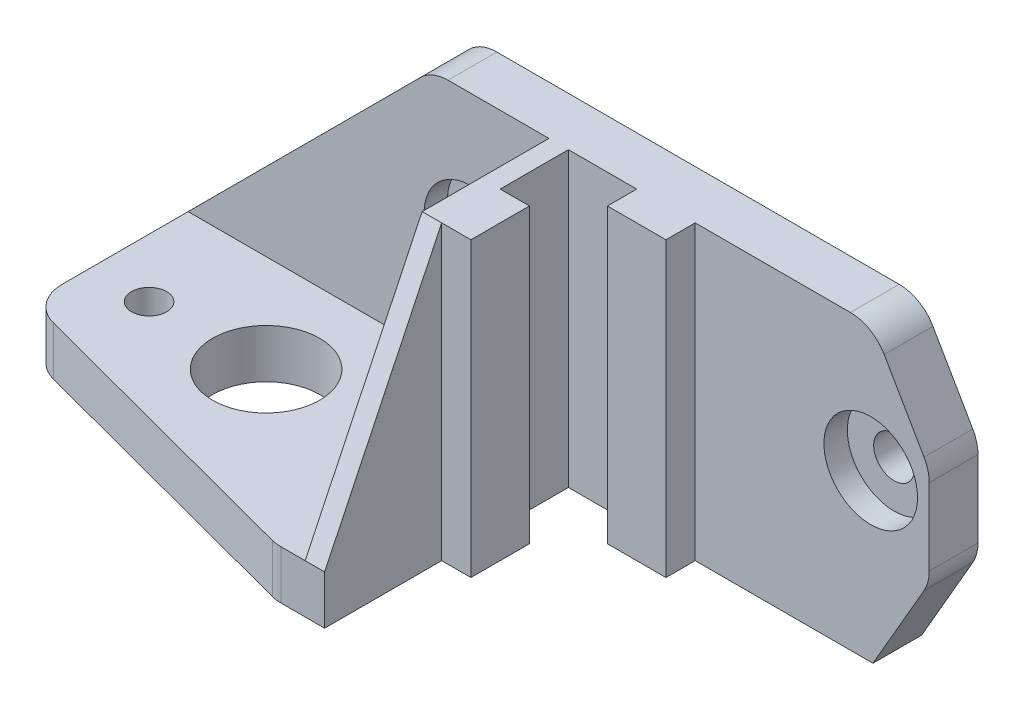
ISO-10303-21;
HEADER;
FILE_DESCRIPTION(('STEP AP214'),'2;1');
FILE_NAME('part.step','',(''),(''),'','','');
FILE_SCHEMA(('AUTOMOTIVE_DESIGN { 1 0 10303 214 1 1 1 1 }'));
ENDSEC;
DATA;
#1=APPLICATION_CONTEXT('core data for automotive mechanical design processes');
#2=APPLICATION_PROTOCOL_DEFINITION('international standard','automotive_design',2000,#1);
#3=PRODUCT_CONTEXT('',#1,'mechanical');
#4=PRODUCT('Part','Part','',(#3));
#5=PRODUCT_RELATED_PRODUCT_CATEGORY('part','',(#4));
#6=PRODUCT_DEFINITION_FORMATION('','',#4);
#7=PRODUCT_DEFINITION_CONTEXT('part definition',#1,'design');
#8=PRODUCT_DEFINITION('design','',#6,#7);
#9=PRODUCT_DEFINITION_SHAPE('','',#8);
#10=(LENGTH_UNIT() NAMED_UNIT(*) SI_UNIT(.MILLI.,.METRE.));
#11=(NAMED_UNIT(*) PLANE_ANGLE_UNIT() SI_UNIT($,.RADIAN.));
#12=(NAMED_UNIT(*) SI_UNIT($,.STERADIAN.) SOLID_ANGLE_UNIT());
#13=UNCERTAINTY_MEASURE_WITH_UNIT(LENGTH_MEASURE(1.E-05),#10,'distance_accuracy_value','');
#14=(GEOMETRIC_REPRESENTATION_CONTEXT(3) GLOBAL_UNCERTAINTY_ASSIGNED_CONTEXT((#13)) GLOBAL_UNIT_ASSIGNED_CONTEXT((#10,
#11,#12)) REPRESENTATION_CONTEXT('',''));
#15=CARTESIAN_POINT('',(0.,0.,0.));
#16=DIRECTION('',(0.,0.,1.));
#17=DIRECTION('',(1.,0.,0.));
#18=AXIS2_PLACEMENT_3D('',#15,#16,#17);
#19=CARTESIAN_POINT('',(21.,17.,-15.));
#20=DIRECTION('',(0.,0.,1.));
#21=DIRECTION('',(-1.,0.,0.));
#22=AXIS2_PLACEMENT_3D('',#19,#20,#21);
#23=CYLINDRICAL_SURFACE('',#22,2.1);
#24=CARTESIAN_POINT('',(21.,17.,-15.));
#25=DIRECTION('',(0.,0.,-1.));
#26=DIRECTION('',(-1.,0.,0.));
#27=AXIS2_PLACEMENT_3D('',#24,#25,#26);
#28=CIRCLE('',#27,2.1);
#29=CARTESIAN_POINT('',(18.9,17.,-15.));
#30=VERTEX_POINT('',#29);
#31=EDGE_CURVE('E291',#30,#30,#28,.T.);
#32=ORIENTED_EDGE('',*,*,#31,.T.);
#33=EDGE_LOOP('',(#32));
#34=FACE_BOUND('',#33,.T.);
#35=CARTESIAN_POINT('',(21.,17.,-12.4));
#36=DIRECTION('',(0.,0.,1.));
#37=DIRECTION('',(1.,0.,0.));
#38=AXIS2_PLACEMENT_3D('',#35,#36,#37);
#39=CIRCLE('',#38,2.1);
#40=CARTESIAN_POINT('',(23.1,17.,-12.4));
#41=VERTEX_POINT('',#40);
#42=EDGE_CURVE('E387',#41,#41,#39,.F.);
#43=ORIENTED_EDGE('',*,*,#42,.F.);
#44=EDGE_LOOP('',(#43));
#45=FACE_BOUND('',#44,.T.);
#46=ADVANCED_FACE('F33',(#34,#45),#23,.F.);
#47=CARTESIAN_POINT('',(-20.,17.,-15.));
#48=DIRECTION('',(0.,0.,1.));
#49=DIRECTION('',(-1.,0.,0.));
#50=AXIS2_PLACEMENT_3D('',#47,#48,#49);
#51=CYLINDRICAL_SURFACE('',#50,2.1);
#52=CARTESIAN_POINT('',(-20.,17.,-15.));
#53=DIRECTION('',(0.,0.,-1.));
#54=DIRECTION('',(-1.,0.,0.));
#55=AXIS2_PLACEMENT_3D('',#52,#53,#54);
#56=CIRCLE('',#55,2.1);
#57=CARTESIAN_POINT('',(-22.1,17.,-15.));
#58=VERTEX_POINT('',#57);
#59=EDGE_CURVE('E300',#58,#58,#56,.T.);
#60=ORIENTED_EDGE('',*,*,#59,.T.);
#61=EDGE_LOOP('',(#60));
#62=FACE_BOUND('',#61,.T.);
#63=CARTESIAN_POINT('',(-20.,17.,-12.4));
#64=DIRECTION('',(0.,0.,1.));
#65=DIRECTION('',(1.,0.,0.));
#66=AXIS2_PLACEMENT_3D('',#63,#64,#65);
#67=CIRCLE('',#66,2.1);
#68=CARTESIAN_POINT('',(-17.9,17.,-12.4));
#69=VERTEX_POINT('',#68);
#70=EDGE_CURVE('E234',#69,#69,#67,.F.);
#71=ORIENTED_EDGE('',*,*,#70,.F.);
#72=EDGE_LOOP('',(#71));
#73=FACE_BOUND('',#72,.T.);
#74=ADVANCED_FACE('F525',(#62,#73),#51,.F.);
#75=CARTESIAN_POINT('',(10.,0.,-10.));
#76=DIRECTION('',(0.,0.,-1.));
#77=DIRECTION('',(1.,0.,0.));
#78=AXIS2_PLACEMENT_3D('',#75,#76,#77);
#79=PLANE('',#78);
#80=DIRECTION('',(1.,0.,0.));
#81=VECTOR('',#80,1.);
#82=CARTESIAN_POINT('',(10.,0.,-10.));
#83=LINE('',#82,#81);
#84=CARTESIAN_POINT('',(-10.,0.,-10.));
#85=VERTEX_POINT('',#84);
#86=CARTESIAN_POINT('',(-3.,0.,-10.));
#87=VERTEX_POINT('',#86);
#88=EDGE_CURVE('E343',#85,#87,#83,.T.);
#89=ORIENTED_EDGE('',*,*,#88,.T.);
#90=DIRECTION('',(0.,1.,0.));
#91=VECTOR('',#90,1.);
#92=CARTESIAN_POINT('',(-3.,-6.70820393249936,-10.));
#93=LINE('',#92,#91);
#94=CARTESIAN_POINT('',(-3.,30.,-10.));
#95=VERTEX_POINT('',#94);
#96=EDGE_CURVE('E243',#87,#95,#93,.T.);
#97=ORIENTED_EDGE('',*,*,#96,.T.);
#98=DIRECTION('',(1.,0.,0.));
#99=VECTOR('',#98,1.);
#100=CARTESIAN_POINT('',(10.,30.,-10.));
#101=LINE('',#100,#99);
#102=CARTESIAN_POINT('',(-10.,30.,-10.));
#103=VERTEX_POINT('',#102);
#104=EDGE_CURVE('E233',#103,#95,#101,.T.);
#105=ORIENTED_EDGE('',*,*,#104,.F.);
#106=DIRECTION('',(0.,1.,0.));
#107=VECTOR('',#106,1.);
#108=CARTESIAN_POINT('',(-10.,0.,-10.));
#109=LINE('',#108,#107);
#110=EDGE_CURVE('E339',#85,#103,#109,.T.);
#111=ORIENTED_EDGE('',*,*,#110,.F.);
#112=EDGE_LOOP('',(#89,#97,#105,#111));
#113=FACE_BOUND('',#112,.T.);
#114=ADVANCED_FACE('F530',(#113),#79,.F.);
#115=CARTESIAN_POINT('',(-10.,0.,-10.));
#116=DIRECTION('',(-1.,0.,0.));
#117=DIRECTION('',(0.,0.,-1.));
#118=AXIS2_PLACEMENT_3D('',#115,#116,#117);
#119=PLANE('',#118);
#120=DIRECTION('',(0.,0.,-1.));
#121=VECTOR('',#120,1.);
#122=CARTESIAN_POINT('',(-10.,30.,-10.));
#123=LINE('',#122,#121);
#124=CARTESIAN_POINT('',(-10.,30.,-3.));
#125=VERTEX_POINT('',#124);
#126=EDGE_CURVE('E336',#125,#103,#123,.T.);
#127=ORIENTED_EDGE('',*,*,#126,.F.);
#128=DIRECTION('',(0.,1.,0.));
#129=VECTOR('',#128,1.);
#130=CARTESIAN_POINT('',(-10.,-6.70820393249936,-3.));
#131=LINE('',#130,#129);
#132=CARTESIAN_POINT('',(-10.,0.,-3.));
#133=VERTEX_POINT('',#132);
#134=EDGE_CURVE('E256',#133,#125,#131,.T.);
#135=ORIENTED_EDGE('',*,*,#134,.F.);
#136=DIRECTION('',(0.,0.,-1.));
#137=VECTOR('',#136,1.);
#138=CARTESIAN_POINT('',(-10.,0.,-10.));
#139=LINE('',#138,#137);
#140=EDGE_CURVE('E335',#133,#85,#139,.T.);
#141=ORIENTED_EDGE('',*,*,#140,.T.);
#142=ORIENTED_EDGE('',*,*,#110,.T.);
#143=EDGE_LOOP('',(#127,#135,#141,#142));
#144=FACE_BOUND('',#143,.T.);
#145=ADVANCED_FACE('F635',(#144),#119,.F.);
#146=CARTESIAN_POINT('',(-55.,5.,15.));
#147=DIRECTION('',(0.,-1.,0.));
#148=DIRECTION('',(0.,0.,-1.));
#149=AXIS2_PLACEMENT_3D('',#146,#147,#148);
#150=PLANE('',#149);
#151=CARTESIAN_POINT('',(-31.,5.,0.));
#152=DIRECTION('',(0.,1.,0.));
#153=DIRECTION('',(0.,0.,-1.));
#154=AXIS2_PLACEMENT_3D('',#151,#152,#153);
#155=CIRCLE('',#154,5.5);
#156=CARTESIAN_POINT('',(-31.,5.,-5.49999999999999));
#157=VERTEX_POINT('',#156);
#158=EDGE_CURVE('E331',#157,#157,#155,.T.);
#159=ORIENTED_EDGE('',*,*,#158,.F.);
#160=EDGE_LOOP('',(#159));
#161=FACE_BOUND('',#160,.T.);
#162=CARTESIAN_POINT('',(-19.,5.,0.));
#163=DIRECTION('',(0.,1.,0.));
#164=DIRECTION('',(0.,0.,-1.));
#165=AXIS2_PLACEMENT_3D('',#162,#163,#164);
#166=CIRCLE('',#165,1.8);
#167=CARTESIAN_POINT('',(-19.,5.,-1.8));
#168=VERTEX_POINT('',#167);
#169=EDGE_CURVE('E327',#168,#168,#166,.T.);
#170=ORIENTED_EDGE('',*,*,#169,.F.);
#171=EDGE_LOOP('',(#170));
#172=FACE_BOUND('',#171,.T.);
#173=CARTESIAN_POINT('',(-43.,5.,0.));
#174=DIRECTION('',(0.,1.,0.));
#175=DIRECTION('',(0.,0.,-1.));
#176=AXIS2_PLACEMENT_3D('',#173,#174,#175);
#177=CIRCLE('',#176,1.8);
#178=CARTESIAN_POINT('',(-43.,5.,-1.8));
#179=VERTEX_POINT('',#178);
#180=EDGE_CURVE('E323',#179,#179,#177,.T.);
#181=ORIENTED_EDGE('',*,*,#180,.F.);
#182=EDGE_LOOP('',(#181));
#183=FACE_BOUND('',#182,.T.);
#184=DIRECTION('',(0.,0.,1.));
#185=VECTOR('',#184,1.);
#186=CARTESIAN_POINT('',(-49.,5.,6.));
#187=LINE('',#186,#185);
#188=CARTESIAN_POINT('',(-49.,5.,-9.99999999999999));
#189=VERTEX_POINT('',#188);
#190=CARTESIAN_POINT('',(-49.,5.,2.92105755410142));
#191=VERTEX_POINT('',#190);
#192=EDGE_CURVE('E307',#189,#191,#187,.T.);
#193=ORIENTED_EDGE('',*,*,#192,.T.);
#194=CARTESIAN_POINT('',(-45.,5.,2.92105755410142));
#195=DIRECTION('',(0.,-1.,0.));
#196=DIRECTION('',(0.,0.,-1.));
#197=AXIS2_PLACEMENT_3D('',#194,#195,#196);
#198=CIRCLE('',#197,4.);
#199=CARTESIAN_POINT('',(-46.0235702412651,5.,6.78787846554746));
#200=VERTEX_POINT('',#199);
#201=EDGE_CURVE('E406',#191,#200,#198,.F.);
#202=ORIENTED_EDGE('',*,*,#201,.T.);
#203=DIRECTION('',(0.966705227861512,0.,0.255892560316283));
#204=VECTOR('',#203,1.);
#205=CARTESIAN_POINT('',(-15.,5.,15.));
#206=LINE('',#205,#204);
#207=CARTESIAN_POINT('',(-15.5031210012038,5.,14.866820911446));
#208=VERTEX_POINT('',#207);
#209=EDGE_CURVE('E312',#200,#208,#206,.T.);
#210=ORIENTED_EDGE('',*,*,#209,.T.);
#211=CARTESIAN_POINT('',(-14.4795507599387,5.,11.));
#212=DIRECTION('',(0.,-1.,0.));
#213=DIRECTION('',(0.,0.,-1.));
#214=AXIS2_PLACEMENT_3D('',#211,#212,#213);
#215=CIRCLE('',#214,4.);
#216=CARTESIAN_POINT('',(-14.4795507599387,5.,15.));
#217=VERTEX_POINT('',#216);
#218=EDGE_CURVE('E370',#208,#217,#215,.F.);
#219=ORIENTED_EDGE('',*,*,#218,.T.);
#220=DIRECTION('',(1.,0.,0.));
#221=VECTOR('',#220,1.);
#222=CARTESIAN_POINT('',(-15.,5.,15.));
#223=LINE('',#222,#221);
#224=CARTESIAN_POINT('',(-12.,5.,15.));
#225=VERTEX_POINT('',#224);
#226=EDGE_CURVE('E284',#217,#225,#223,.T.);
#227=ORIENTED_EDGE('',*,*,#226,.T.);
#228=DIRECTION('',(0.,0.,-1.));
#229=VECTOR('',#228,1.);
#230=CARTESIAN_POINT('',(-12.,5.,-10.));
#231=LINE('',#230,#229);
#232=CARTESIAN_POINT('',(-12.,5.,-10.));
#233=VERTEX_POINT('',#232);
#234=EDGE_CURVE('E285',#225,#233,#231,.T.);
#235=ORIENTED_EDGE('',*,*,#234,.T.);
#236=DIRECTION('',(1.,0.,0.));
#237=VECTOR('',#236,1.);
#238=CARTESIAN_POINT('',(-74.4950975679639,5.,-10.));
#239=LINE('',#238,#237);
#240=EDGE_CURVE('E303',#189,#233,#239,.T.);
#241=ORIENTED_EDGE('',*,*,#240,.F.);
#242=EDGE_LOOP('',(#193,#202,#210,#219,#227,#235,#241));
#243=FACE_BOUND('',#242,.T.);
#244=ADVANCED_FACE('F621',(#161,#172,#183,#243),#150,.F.);
#245=CARTESIAN_POINT('',(15.,30.,15.));
#246=DIRECTION('',(0.,0.,-1.));
#247=DIRECTION('',(1.,0.,0.));
#248=AXIS2_PLACEMENT_3D('',#245,#246,#247);
#249=PLANE('',#248);
#250=ORIENTED_EDGE('',*,*,#226,.F.);
#251=DIRECTION('',(0.,1.,0.));
#252=VECTOR('',#251,1.);
#253=CARTESIAN_POINT('',(-14.4795507599387,30.,15.));
#254=LINE('',#253,#252);
#255=CARTESIAN_POINT('',(-14.4795507599387,0.,15.));
#256=VERTEX_POINT('',#255);
#257=EDGE_CURVE('E420',#217,#256,#254,.F.);
#258=ORIENTED_EDGE('',*,*,#257,.T.);
#259=DIRECTION('',(-1.,0.,0.));
#260=VECTOR('',#259,1.);
#261=CARTESIAN_POINT('',(15.,0.,15.));
#262=LINE('',#261,#260);
#263=CARTESIAN_POINT('',(-10.,0.,15.));
#264=VERTEX_POINT('',#263);
#265=EDGE_CURVE('E342',#264,#256,#262,.T.);
#266=ORIENTED_EDGE('',*,*,#265,.F.);
#267=DIRECTION('',(0.,1.,0.));
#268=VECTOR('',#267,1.);
#269=CARTESIAN_POINT('',(-10.,-5.00000000014378E-05,15.));
#270=LINE('',#269,#268);
#271=CARTESIAN_POINT('',(-10.,4.99999999999979,15.));
#272=VERTEX_POINT('',#271);
#273=EDGE_CURVE('E278',#264,#272,#270,.T.);
#274=ORIENTED_EDGE('',*,*,#273,.T.);
#275=DIRECTION('',(-1.,0.,0.));
#276=VECTOR('',#275,1.);
#277=CARTESIAN_POINT('',(-12.,4.9999999999998,15.));
#278=LINE('',#277,#276);
#279=EDGE_CURVE('E392',#272,#225,#278,.T.);
#280=ORIENTED_EDGE('',*,*,#279,.T.);
#281=EDGE_LOOP('',(#250,#258,#266,#274,#280));
#282=FACE_BOUND('',#281,.T.);
#283=ADVANCED_FACE('F618',(#282),#249,.F.);
#284=CARTESIAN_POINT('',(15.,30.,-15.));
#285=DIRECTION('',(0.,0.,1.));
#286=DIRECTION('',(-1.,0.,0.));
#287=AXIS2_PLACEMENT_3D('',#284,#285,#286);
#288=PLANE('',#287);
#289=ORIENTED_EDGE('',*,*,#31,.F.);
#290=EDGE_LOOP('',(#289));
#291=FACE_BOUND('',#290,.T.);
#292=ORIENTED_EDGE('',*,*,#59,.F.);
#293=EDGE_LOOP('',(#292));
#294=FACE_BOUND('',#293,.T.);
#295=DIRECTION('',(0.,-1.,0.));
#296=VECTOR('',#295,1.);
#297=CARTESIAN_POINT('',(27.,30.,-15.));
#298=LINE('',#297,#296);
#299=CARTESIAN_POINT('',(27.,18.9282032302755,-15.));
#300=VERTEX_POINT('',#299);
#301=CARTESIAN_POINT('',(27.,11.0717967697245,-15.));
#302=VERTEX_POINT('',#301);
#303=EDGE_CURVE('E294',#300,#302,#298,.T.);
#304=ORIENTED_EDGE('',*,*,#303,.T.);
#305=CARTESIAN_POINT('',(23.,11.0717967697245,-15.));
#306=DIRECTION('',(0.,0.,1.));
#307=DIRECTION('',(1.,0.,0.));
#308=AXIS2_PLACEMENT_3D('',#305,#306,#307);
#309=CIRCLE('',#308,4.);
#310=CARTESIAN_POINT('',(26.4641016151378,9.07179676972453,-15.));
#311=VERTEX_POINT('',#310);
#312=EDGE_CURVE('E441',#302,#311,#309,.F.);
#313=ORIENTED_EDGE('',*,*,#312,.T.);
#314=DIRECTION('',(0.499999999999998,0.86602540378444,0.));
#315=VECTOR('',#314,1.);
#316=CARTESIAN_POINT('',(27.,10.,-15.));
#317=LINE('',#316,#315);
#318=CARTESIAN_POINT('',(21.2264973081038,0.,-15.));
#319=VERTEX_POINT('',#318);
#320=EDGE_CURVE('E465',#319,#311,#317,.T.);
#321=ORIENTED_EDGE('',*,*,#320,.F.);
#322=DIRECTION('',(1.,0.,0.));
#323=VECTOR('',#322,1.);
#324=CARTESIAN_POINT('',(15.,0.,-15.));
#325=LINE('',#324,#323);
#326=CARTESIAN_POINT('',(-49.,0.,-15.));
#327=VERTEX_POINT('',#326);
#328=EDGE_CURVE('E348',#327,#319,#325,.T.);
#329=ORIENTED_EDGE('',*,*,#328,.F.);
#330=DIRECTION('',(0.,1.,0.));
#331=VECTOR('',#330,1.);
#332=CARTESIAN_POINT('',(-49.,0.,-15.));
#333=LINE('',#332,#331);
#334=CARTESIAN_POINT('',(-49.,4.9999999999999,-15.));
#335=VERTEX_POINT('',#334);
#336=EDGE_CURVE('E315',#327,#335,#333,.T.);
#337=ORIENTED_EDGE('',*,*,#336,.T.);
#338=DIRECTION('',(-0.707106781186546,-0.707106781186549,0.));
#339=VECTOR('',#338,1.);
#340=CARTESIAN_POINT('',(-24.,30.,-15.));
#341=LINE('',#340,#339);
#342=CARTESIAN_POINT('',(-25.1715728752538,28.8284271247462,-15.));
#343=VERTEX_POINT('',#342);
#344=EDGE_CURVE('E347',#343,#335,#341,.T.);
#345=ORIENTED_EDGE('',*,*,#344,.F.);
#346=CARTESIAN_POINT('',(-22.3431457505076,26.,-15.));
#347=DIRECTION('',(0.,0.,1.));
#348=DIRECTION('',(1.,0.,0.));
#349=AXIS2_PLACEMENT_3D('',#346,#347,#348);
#350=CIRCLE('',#349,4.);
#351=CARTESIAN_POINT('',(-22.3431457505076,30.,-15.));
#352=VERTEX_POINT('',#351);
#353=EDGE_CURVE('E435',#343,#352,#350,.F.);
#354=ORIENTED_EDGE('',*,*,#353,.T.);
#355=DIRECTION('',(1.,0.,0.));
#356=VECTOR('',#355,1.);
#357=CARTESIAN_POINT('',(15.,30.,-15.));
#358=LINE('',#357,#356);
#359=CARTESIAN_POINT('',(18.9170962313452,30.,-15.));
#360=VERTEX_POINT('',#359);
#361=EDGE_CURVE('E344',#352,#360,#358,.T.);
#362=ORIENTED_EDGE('',*,*,#361,.T.);
#363=CARTESIAN_POINT('',(18.9170962313452,26.,-15.));
#364=DIRECTION('',(0.,0.,1.));
#365=DIRECTION('',(1.,0.,0.));
#366=AXIS2_PLACEMENT_3D('',#363,#364,#365);
#367=CIRCLE('',#366,4.);
#368=CARTESIAN_POINT('',(22.381197846483,28.,-15.));
#369=VERTEX_POINT('',#368);
#370=EDGE_CURVE('E437',#360,#369,#367,.F.);
#371=ORIENTED_EDGE('',*,*,#370,.T.);
#372=DIRECTION('',(0.499999999999998,-0.86602540378444,0.));
#373=VECTOR('',#372,1.);
#374=CARTESIAN_POINT('',(27.,20.,-15.));
#375=LINE('',#374,#373);
#376=CARTESIAN_POINT('',(26.4641016151378,20.9282032302755,-15.));
#377=VERTEX_POINT('',#376);
#378=EDGE_CURVE('E470',#377,#369,#375,.F.);
#379=ORIENTED_EDGE('',*,*,#378,.F.);
#380=CARTESIAN_POINT('',(23.,18.9282032302755,-15.));
#381=DIRECTION('',(0.,0.,1.));
#382=DIRECTION('',(1.,0.,0.));
#383=AXIS2_PLACEMENT_3D('',#380,#381,#382);
#384=CIRCLE('',#383,4.);
#385=EDGE_CURVE('E439',#377,#300,#384,.F.);
#386=ORIENTED_EDGE('',*,*,#385,.T.);
#387=EDGE_LOOP('',(#304,#313,#321,#329,#337,#345,#354,#362,#371,#379,#386));
#388=FACE_BOUND('',#387,.T.);
#389=ADVANCED_FACE('F461',(#291,#294,#388),#288,.F.);
#390=CARTESIAN_POINT('',(0.,30.,0.));
#391=DIRECTION('',(0.,1.,0.));
#392=DIRECTION('',(0.,0.,1.));
#393=AXIS2_PLACEMENT_3D('',#390,#391,#392);
#394=PLANE('',#393);
#395=CARTESIAN_POINT('',(3.,30.,-10.));
#396=VERTEX_POINT('',#395);
#397=CARTESIAN_POINT('',(18.9170962313452,30.,-10.));
#398=VERTEX_POINT('',#397);
#399=EDGE_CURVE('E338',#396,#398,#101,.T.);
#400=ORIENTED_EDGE('',*,*,#399,.T.);
#401=DIRECTION('',(0.,0.,-1.));
#402=VECTOR('',#401,1.);
#403=CARTESIAN_POINT('',(18.9170962313452,30.,0.));
#404=LINE('',#403,#402);
#405=EDGE_CURVE('E450',#398,#360,#404,.T.);
#406=ORIENTED_EDGE('',*,*,#405,.T.);
#407=ORIENTED_EDGE('',*,*,#361,.F.);
#408=DIRECTION('',(0.,0.,-1.));
#409=VECTOR('',#408,1.);
#410=CARTESIAN_POINT('',(-22.3431457505076,30.,0.));
#411=LINE('',#410,#409);
#412=CARTESIAN_POINT('',(-22.3431457505076,30.,-10.));
#413=VERTEX_POINT('',#412);
#414=EDGE_CURVE('E54',#352,#413,#411,.F.);
#415=ORIENTED_EDGE('',*,*,#414,.T.);
#416=DIRECTION('',(1.,0.,0.));
#417=VECTOR('',#416,1.);
#418=CARTESIAN_POINT('',(-74.4950975679639,30.,-10.));
#419=LINE('',#418,#417);
#420=CARTESIAN_POINT('',(-12.,30.,-10.));
#421=VERTEX_POINT('',#420);
#422=EDGE_CURVE('E305',#413,#421,#419,.T.);
#423=ORIENTED_EDGE('',*,*,#422,.T.);
#424=DIRECTION('',(0.,0.,-1.));
#425=VECTOR('',#424,1.);
#426=CARTESIAN_POINT('',(-12.,30.,-10.));
#427=LINE('',#426,#425);
#428=CARTESIAN_POINT('',(-12.,30.,2.99999999999998));
#429=VERTEX_POINT('',#428);
#430=EDGE_CURVE('E281',#429,#421,#427,.T.);
#431=ORIENTED_EDGE('',*,*,#430,.F.);
#432=DIRECTION('',(1.,0.,0.));
#433=VECTOR('',#432,1.);
#434=CARTESIAN_POINT('',(-10.,30.,2.99999999999998));
#435=LINE('',#434,#433);
#436=CARTESIAN_POINT('',(-10.,30.,3.));
#437=VERTEX_POINT('',#436);
#438=EDGE_CURVE('E397',#429,#437,#435,.T.);
#439=ORIENTED_EDGE('',*,*,#438,.T.);
#440=DIRECTION('',(1.,0.,0.));
#441=VECTOR('',#440,1.);
#442=CARTESIAN_POINT('',(-10.,30.,3.));
#443=LINE('',#442,#441);
#444=CARTESIAN_POINT('',(-7.,30.,3.));
#445=VERTEX_POINT('',#444);
#446=EDGE_CURVE('E252',#437,#445,#443,.T.);
#447=ORIENTED_EDGE('',*,*,#446,.T.);
#448=DIRECTION('',(0.,0.,-1.));
#449=VECTOR('',#448,1.);
#450=CARTESIAN_POINT('',(-7.,30.,-3.));
#451=LINE('',#450,#449);
#452=CARTESIAN_POINT('',(-7.,30.,-3.));
#453=VERTEX_POINT('',#452);
#454=EDGE_CURVE('E261',#445,#453,#451,.T.);
#455=ORIENTED_EDGE('',*,*,#454,.T.);
#456=DIRECTION('',(-1.,0.,0.));
#457=VECTOR('',#456,1.);
#458=CARTESIAN_POINT('',(-10.,30.,-3.));
#459=LINE('',#458,#457);
#460=EDGE_CURVE('E264',#453,#125,#459,.T.);
#461=ORIENTED_EDGE('',*,*,#460,.T.);
#462=ORIENTED_EDGE('',*,*,#126,.T.);
#463=ORIENTED_EDGE('',*,*,#104,.T.);
#464=DIRECTION('',(0.,0.,1.));
#465=VECTOR('',#464,1.);
#466=CARTESIAN_POINT('',(-3.,30.,-10.));
#467=LINE('',#466,#465);
#468=CARTESIAN_POINT('',(-3.,30.,-7.));
#469=VERTEX_POINT('',#468);
#470=EDGE_CURVE('E214',#95,#469,#467,.T.);
#471=ORIENTED_EDGE('',*,*,#470,.T.);
#472=DIRECTION('',(1.,0.,0.));
#473=VECTOR('',#472,1.);
#474=CARTESIAN_POINT('',(-3.,30.,-7.));
#475=LINE('',#474,#473);
#476=CARTESIAN_POINT('',(3.,30.,-7.));
#477=VERTEX_POINT('',#476);
#478=EDGE_CURVE('E223',#469,#477,#475,.T.);
#479=ORIENTED_EDGE('',*,*,#478,.T.);
#480=DIRECTION('',(0.,0.,-1.));
#481=VECTOR('',#480,1.);
#482=CARTESIAN_POINT('',(3.,30.,-10.));
#483=LINE('',#482,#481);
#484=EDGE_CURVE('E220',#477,#396,#483,.T.);
#485=ORIENTED_EDGE('',*,*,#484,.T.);
#486=EDGE_LOOP('',(#400,#406,#407,#415,#423,#431,#439,#447,#455,#461,#462,#463,#471,#479,#485));
#487=FACE_BOUND('',#486,.T.);
#488=ADVANCED_FACE('F231',(#487),#394,.T.);
#489=CARTESIAN_POINT('',(0.,0.,0.));
#490=DIRECTION('',(0.,1.,0.));
#491=DIRECTION('',(0.,0.,1.));
#492=AXIS2_PLACEMENT_3D('',#489,#490,#491);
#493=PLANE('',#492);
#494=CARTESIAN_POINT('',(-43.,0.,0.));
#495=DIRECTION('',(0.,1.,0.));
#496=DIRECTION('',(0.,0.,-1.));
#497=AXIS2_PLACEMENT_3D('',#494,#495,#496);
#498=CIRCLE('',#497,1.8);
#499=CARTESIAN_POINT('',(-43.,0.,-1.8));
#500=VERTEX_POINT('',#499);
#501=EDGE_CURVE('E320',#500,#500,#498,.T.);
#502=ORIENTED_EDGE('',*,*,#501,.T.);
#503=EDGE_LOOP('',(#502));
#504=FACE_BOUND('',#503,.T.);
#505=CARTESIAN_POINT('',(-19.,0.,0.));
#506=DIRECTION('',(0.,1.,0.));
#507=DIRECTION('',(0.,0.,-1.));
#508=AXIS2_PLACEMENT_3D('',#505,#506,#507);
#509=CIRCLE('',#508,1.8);
#510=CARTESIAN_POINT('',(-19.,0.,-1.8));
#511=VERTEX_POINT('',#510);
#512=EDGE_CURVE('E324',#511,#511,#509,.T.);
#513=ORIENTED_EDGE('',*,*,#512,.T.);
#514=EDGE_LOOP('',(#513));
#515=FACE_BOUND('',#514,.T.);
#516=CARTESIAN_POINT('',(-31.,0.,0.));
#517=DIRECTION('',(0.,1.,0.));
#518=DIRECTION('',(0.,0.,-1.));
#519=AXIS2_PLACEMENT_3D('',#516,#517,#518);
#520=CIRCLE('',#519,5.5);
#521=CARTESIAN_POINT('',(-31.,0.,-5.49999999999999));
#522=VERTEX_POINT('',#521);
#523=EDGE_CURVE('E328',#522,#522,#520,.T.);
#524=ORIENTED_EDGE('',*,*,#523,.T.);
#525=EDGE_LOOP('',(#524));
#526=FACE_BOUND('',#525,.T.);
#527=DIRECTION('',(0.966705227861512,0.,0.255892560316283));
#528=VECTOR('',#527,1.);
#529=CARTESIAN_POINT('',(-15.,0.,15.));
#530=LINE('',#529,#528);
#531=CARTESIAN_POINT('',(-46.0235702412651,0.,6.78787846554746));
#532=VERTEX_POINT('',#531);
#533=CARTESIAN_POINT('',(-15.5031210012038,0.,14.866820911446));
#534=VERTEX_POINT('',#533);
#535=EDGE_CURVE('E311',#532,#534,#530,.T.);
#536=ORIENTED_EDGE('',*,*,#535,.F.);
#537=CARTESIAN_POINT('',(-45.,0.,2.92105755410142));
#538=DIRECTION('',(0.,1.,0.));
#539=DIRECTION('',(0.,0.,1.));
#540=AXIS2_PLACEMENT_3D('',#537,#538,#539);
#541=CIRCLE('',#540,4.);
#542=CARTESIAN_POINT('',(-49.,0.,2.92105755410142));
#543=VERTEX_POINT('',#542);
#544=EDGE_CURVE('E418',#532,#543,#541,.F.);
#545=ORIENTED_EDGE('',*,*,#544,.T.);
#546=DIRECTION('',(0.,0.,1.));
#547=VECTOR('',#546,1.);
#548=CARTESIAN_POINT('',(-49.,0.,6.));
#549=LINE('',#548,#547);
#550=EDGE_CURVE('E308',#327,#543,#549,.T.);
#551=ORIENTED_EDGE('',*,*,#550,.F.);
#552=ORIENTED_EDGE('',*,*,#328,.T.);
#553=DIRECTION('',(0.,0.,-1.));
#554=VECTOR('',#553,1.);
#555=CARTESIAN_POINT('',(21.2264973081038,0.,-15.));
#556=LINE('',#555,#554);
#557=CARTESIAN_POINT('',(21.2264973081038,0.,-9.99999999999999));
#558=VERTEX_POINT('',#557);
#559=EDGE_CURVE('E375',#558,#319,#556,.T.);
#560=ORIENTED_EDGE('',*,*,#559,.F.);
#561=CARTESIAN_POINT('',(3.,0.,-10.));
#562=VERTEX_POINT('',#561);
#563=EDGE_CURVE('E334',#562,#558,#83,.T.);
#564=ORIENTED_EDGE('',*,*,#563,.F.);
#565=DIRECTION('',(0.,0.,1.));
#566=VECTOR('',#565,1.);
#567=CARTESIAN_POINT('',(3.,0.,-10.));
#568=LINE('',#567,#566);
#569=CARTESIAN_POINT('',(3.,0.,-7.));
#570=VERTEX_POINT('',#569);
#571=EDGE_CURVE('E245',#562,#570,#568,.T.);
#572=ORIENTED_EDGE('',*,*,#571,.T.);
#573=DIRECTION('',(-1.,0.,0.));
#574=VECTOR('',#573,1.);
#575=CARTESIAN_POINT('',(-3.,0.,-7.));
#576=LINE('',#575,#574);
#577=CARTESIAN_POINT('',(-3.,0.,-7.));
#578=VERTEX_POINT('',#577);
#579=EDGE_CURVE('E250',#570,#578,#576,.T.);
#580=ORIENTED_EDGE('',*,*,#579,.T.);
#581=DIRECTION('',(0.,0.,-1.));
#582=VECTOR('',#581,1.);
#583=CARTESIAN_POINT('',(-3.,0.,-10.));
#584=LINE('',#583,#582);
#585=EDGE_CURVE('E216',#578,#87,#584,.T.);
#586=ORIENTED_EDGE('',*,*,#585,.T.);
#587=ORIENTED_EDGE('',*,*,#88,.F.);
#588=ORIENTED_EDGE('',*,*,#140,.F.);
#589=DIRECTION('',(1.,0.,0.));
#590=VECTOR('',#589,1.);
#591=CARTESIAN_POINT('',(-10.,0.,-3.));
#592=LINE('',#591,#590);
#593=CARTESIAN_POINT('',(-7.,0.,-3.));
#594=VERTEX_POINT('',#593);
#595=EDGE_CURVE('E255',#133,#594,#592,.T.);
#596=ORIENTED_EDGE('',*,*,#595,.T.);
#597=DIRECTION('',(0.,0.,1.));
#598=VECTOR('',#597,1.);
#599=CARTESIAN_POINT('',(-7.,0.,-3.));
#600=LINE('',#599,#598);
#601=CARTESIAN_POINT('',(-7.,0.,3.));
#602=VERTEX_POINT('',#601);
#603=EDGE_CURVE('E253',#594,#602,#600,.T.);
#604=ORIENTED_EDGE('',*,*,#603,.T.);
#605=DIRECTION('',(-1.,0.,0.));
#606=VECTOR('',#605,1.);
#607=CARTESIAN_POINT('',(-10.,0.,3.));
#608=LINE('',#607,#606);
#609=CARTESIAN_POINT('',(-10.,0.,3.));
#610=VERTEX_POINT('',#609);
#611=EDGE_CURVE('E258',#602,#610,#608,.T.);
#612=ORIENTED_EDGE('',*,*,#611,.T.);
#613=EDGE_CURVE('E332',#264,#610,#139,.T.);
#614=ORIENTED_EDGE('',*,*,#613,.F.);
#615=ORIENTED_EDGE('',*,*,#265,.T.);
#616=CARTESIAN_POINT('',(-14.4795507599387,0.,11.));
#617=DIRECTION('',(0.,1.,0.));
#618=DIRECTION('',(0.,0.,1.));
#619=AXIS2_PLACEMENT_3D('',#616,#617,#618);
#620=CIRCLE('',#619,4.);
#621=EDGE_CURVE('E416',#256,#534,#620,.F.);
#622=ORIENTED_EDGE('',*,*,#621,.T.);
#623=EDGE_LOOP('',(#536,#545,#551,#552,#560,#564,#572,#580,#586,#587,#588,#596,#604,#612,#614,
#615,#622));
#624=FACE_BOUND('',#623,.T.);
#625=ADVANCED_FACE('F487',(#504,#515,#526,#624),#493,.F.);
#626=CARTESIAN_POINT('',(21.,17.,-10.));
#627=DIRECTION('',(0.,0.,1.));
#628=DIRECTION('',(1.,0.,0.));
#629=AXIS2_PLACEMENT_3D('',#626,#627,#628);
#630=CIRCLE('',#629,4.8);
#631=CARTESIAN_POINT('',(25.8,17.,-10.));
#632=VERTEX_POINT('',#631);
#633=EDGE_CURVE('E578',#632,#632,#630,.T.);
#634=ORIENTED_EDGE('',*,*,#633,.F.);
#635=EDGE_LOOP('',(#634));
#636=FACE_BOUND('',#635,.T.);
#637=DIRECTION('',(-0.499999999999998,-0.86602540378444,0.));
#638=VECTOR('',#637,1.);
#639=CARTESIAN_POINT('',(27.,10.,-10.));
#640=LINE('',#639,#638);
#641=CARTESIAN_POINT('',(26.4641016151378,9.07179676972453,-10.));
#642=VERTEX_POINT('',#641);
#643=EDGE_CURVE('E473',#642,#558,#640,.T.);
#644=ORIENTED_EDGE('',*,*,#643,.F.);
#645=CARTESIAN_POINT('',(23.,11.0717967697245,-10.));
#646=DIRECTION('',(0.,0.,-1.));
#647=DIRECTION('',(-1.,0.,0.));
#648=AXIS2_PLACEMENT_3D('',#645,#646,#647);
#649=CIRCLE('',#648,4.);
#650=CARTESIAN_POINT('',(27.,11.0717967697245,-10.));
#651=VERTEX_POINT('',#650);
#652=EDGE_CURVE('E429',#642,#651,#649,.F.);
#653=ORIENTED_EDGE('',*,*,#652,.T.);
#654=DIRECTION('',(0.,1.,0.));
#655=VECTOR('',#654,1.);
#656=CARTESIAN_POINT('',(27.,30.,-10.));
#657=LINE('',#656,#655);
#658=CARTESIAN_POINT('',(27.,18.9282032302755,-10.));
#659=VERTEX_POINT('',#658);
#660=EDGE_CURVE('E297',#651,#659,#657,.T.);
#661=ORIENTED_EDGE('',*,*,#660,.T.);
#662=CARTESIAN_POINT('',(23.,18.9282032302755,-10.));
#663=DIRECTION('',(0.,0.,-1.));
#664=DIRECTION('',(-1.,0.,0.));
#665=AXIS2_PLACEMENT_3D('',#662,#663,#664);
#666=CIRCLE('',#665,4.);
#667=CARTESIAN_POINT('',(26.4641016151378,20.9282032302755,-10.));
#668=VERTEX_POINT('',#667);
#669=EDGE_CURVE('E427',#659,#668,#666,.F.);
#670=ORIENTED_EDGE('',*,*,#669,.T.);
#671=DIRECTION('',(-0.499999999999998,0.86602540378444,0.));
#672=VECTOR('',#671,1.);
#673=CARTESIAN_POINT('',(27.,20.,-10.));
#674=LINE('',#673,#672);
#675=CARTESIAN_POINT('',(22.381197846483,28.,-10.));
#676=VERTEX_POINT('',#675);
#677=EDGE_CURVE('E474',#676,#668,#674,.F.);
#678=ORIENTED_EDGE('',*,*,#677,.F.);
#679=CARTESIAN_POINT('',(18.9170962313452,26.,-10.));
#680=DIRECTION('',(0.,0.,-1.));
#681=DIRECTION('',(-1.,0.,0.));
#682=AXIS2_PLACEMENT_3D('',#679,#680,#681);
#683=CIRCLE('',#682,4.);
#684=EDGE_CURVE('E425',#676,#398,#683,.F.);
#685=ORIENTED_EDGE('',*,*,#684,.T.);
#686=ORIENTED_EDGE('',*,*,#399,.F.);
#687=DIRECTION('',(0.,1.,0.));
#688=VECTOR('',#687,1.);
#689=CARTESIAN_POINT('',(3.,-6.70820393249936,-10.));
#690=LINE('',#689,#688);
#691=EDGE_CURVE('E246',#562,#396,#690,.T.);
#692=ORIENTED_EDGE('',*,*,#691,.F.);
#693=ORIENTED_EDGE('',*,*,#563,.T.);
#694=EDGE_LOOP('',(#644,#653,#661,#670,#678,#685,#686,#692,#693));
#695=FACE_BOUND('',#694,.T.);
#696=ADVANCED_FACE('F494',(#636,#695),#79,.F.);
#697=DIRECTION('',(0.,1.,0.));
#698=VECTOR('',#697,1.);
#699=CARTESIAN_POINT('',(-10.,-6.70820393249936,3.));
#700=LINE('',#699,#698);
#701=EDGE_CURVE('E267',#610,#437,#700,.T.);
#702=ORIENTED_EDGE('',*,*,#701,.T.);
#703=DIRECTION('',(0.,-0.901523057468275,0.432731067584769));
#704=VECTOR('',#703,1.);
#705=CARTESIAN_POINT('',(-10.,4.9999999999998,15.));
#706=LINE('',#705,#704);
#707=EDGE_CURVE('E398',#437,#272,#706,.T.);
#708=ORIENTED_EDGE('',*,*,#707,.T.);
#709=ORIENTED_EDGE('',*,*,#273,.F.);
#710=ORIENTED_EDGE('',*,*,#613,.T.);
#711=EDGE_LOOP('',(#702,#708,#709,#710));
#712=FACE_BOUND('',#711,.T.);
#713=ADVANCED_FACE('F631',(#712),#119,.F.);
#714=CARTESIAN_POINT('',(-31.,30.000025,0.));
#715=DIRECTION('',(0.,-1.,0.));
#716=DIRECTION('',(0.,0.,-1.));
#717=AXIS2_PLACEMENT_3D('',#714,#715,#716);
#718=CYLINDRICAL_SURFACE('',#717,5.5);
#719=ORIENTED_EDGE('',*,*,#523,.F.);
#720=EDGE_LOOP('',(#719));
#721=FACE_BOUND('',#720,.T.);
#722=ORIENTED_EDGE('',*,*,#158,.T.);
#723=EDGE_LOOP('',(#722));
#724=FACE_BOUND('',#723,.T.);
#725=ADVANCED_FACE('F634',(#721,#724),#718,.F.);
#726=CARTESIAN_POINT('',(-19.,30.000025,0.));
#727=DIRECTION('',(0.,-1.,0.));
#728=DIRECTION('',(0.,0.,-1.));
#729=AXIS2_PLACEMENT_3D('',#726,#727,#728);
#730=CYLINDRICAL_SURFACE('',#729,1.8);
#731=ORIENTED_EDGE('',*,*,#512,.F.);
#732=EDGE_LOOP('',(#731));
#733=FACE_BOUND('',#732,.T.);
#734=ORIENTED_EDGE('',*,*,#169,.T.);
#735=EDGE_LOOP('',(#734));
#736=FACE_BOUND('',#735,.T.);
#737=ADVANCED_FACE('F644',(#733,#736),#730,.F.);
#738=CARTESIAN_POINT('',(-43.,30.000025,0.));
#739=DIRECTION('',(0.,-1.,0.));
#740=DIRECTION('',(0.,0.,-1.));
#741=AXIS2_PLACEMENT_3D('',#738,#739,#740);
#742=CYLINDRICAL_SURFACE('',#741,1.8);
#743=ORIENTED_EDGE('',*,*,#501,.F.);
#744=EDGE_LOOP('',(#743));
#745=FACE_BOUND('',#744,.T.);
#746=ORIENTED_EDGE('',*,*,#180,.T.);
#747=EDGE_LOOP('',(#746));
#748=FACE_BOUND('',#747,.T.);
#749=ADVANCED_FACE('F648',(#745,#748),#742,.F.);
#750=CARTESIAN_POINT('',(-15.,0.,15.));
#751=DIRECTION('',(0.255892560316283,0.,-0.966705227861512));
#752=DIRECTION('',(0.966705227861512,0.,0.255892560316283));
#753=AXIS2_PLACEMENT_3D('',#750,#751,#752);
#754=PLANE('',#753);
#755=ORIENTED_EDGE('',*,*,#209,.F.);
#756=DIRECTION('',(0.,1.,0.));
#757=VECTOR('',#756,1.);
#758=CARTESIAN_POINT('',(-46.0235702412651,0.,6.78787846554746));
#759=LINE('',#758,#757);
#760=EDGE_CURVE('E412',#200,#532,#759,.F.);
#761=ORIENTED_EDGE('',*,*,#760,.T.);
#762=ORIENTED_EDGE('',*,*,#535,.T.);
#763=DIRECTION('',(0.,1.,0.));
#764=VECTOR('',#763,1.);
#765=CARTESIAN_POINT('',(-15.5031210012038,0.,14.866820911446));
#766=LINE('',#765,#764);
#767=EDGE_CURVE('E409',#534,#208,#766,.T.);
#768=ORIENTED_EDGE('',*,*,#767,.T.);
#769=EDGE_LOOP('',(#755,#761,#762,#768));
#770=FACE_BOUND('',#769,.T.);
#771=ADVANCED_FACE('F652',(#770),#754,.F.);
#772=CARTESIAN_POINT('',(-49.,0.,6.));
#773=DIRECTION('',(1.,0.,0.));
#774=DIRECTION('',(0.,-1.,0.));
#775=AXIS2_PLACEMENT_3D('',#772,#773,#774);
#776=PLANE('',#775);
#777=ORIENTED_EDGE('',*,*,#550,.T.);
#778=DIRECTION('',(0.,1.,0.));
#779=VECTOR('',#778,1.);
#780=CARTESIAN_POINT('',(-49.,0.,2.92105755410142));
#781=LINE('',#780,#779);
#782=EDGE_CURVE('E366',#543,#191,#781,.T.);
#783=ORIENTED_EDGE('',*,*,#782,.T.);
#784=ORIENTED_EDGE('',*,*,#192,.F.);
#785=DIRECTION('',(0.,0.,1.));
#786=VECTOR('',#785,1.);
#787=CARTESIAN_POINT('',(-49.,4.9999999999999,-10.));
#788=LINE('',#787,#786);
#789=EDGE_CURVE('E464',#335,#189,#788,.T.);
#790=ORIENTED_EDGE('',*,*,#789,.F.);
#791=ORIENTED_EDGE('',*,*,#336,.F.);
#792=EDGE_LOOP('',(#777,#783,#784,#790,#791));
#793=FACE_BOUND('',#792,.T.);
#794=ADVANCED_FACE('F590',(#793),#776,.F.);
#795=CARTESIAN_POINT('',(-74.4950975679639,30.,-10.));
#796=DIRECTION('',(0.,0.,-1.));
#797=DIRECTION('',(0.,1.,0.));
#798=AXIS2_PLACEMENT_3D('',#795,#796,#797);
#799=PLANE('',#798);
#800=CARTESIAN_POINT('',(-20.,17.,-10.));
#801=DIRECTION('',(0.,0.,1.));
#802=DIRECTION('',(1.,0.,0.));
#803=AXIS2_PLACEMENT_3D('',#800,#801,#802);
#804=CIRCLE('',#803,4.8);
#805=CARTESIAN_POINT('',(-15.2,17.,-10.));
#806=VERTEX_POINT('',#805);
#807=EDGE_CURVE('E390',#806,#806,#804,.T.);
#808=ORIENTED_EDGE('',*,*,#807,.F.);
#809=EDGE_LOOP('',(#808));
#810=FACE_BOUND('',#809,.T.);
#811=ORIENTED_EDGE('',*,*,#422,.F.);
#812=CARTESIAN_POINT('',(-22.3431457505076,26.,-10.));
#813=DIRECTION('',(0.,0.,-1.));
#814=DIRECTION('',(0.,1.,0.));
#815=AXIS2_PLACEMENT_3D('',#812,#813,#814);
#816=CIRCLE('',#815,4.);
#817=CARTESIAN_POINT('',(-25.1715728752538,28.8284271247462,-10.));
#818=VERTEX_POINT('',#817);
#819=EDGE_CURVE('E11',#413,#818,#816,.F.);
#820=ORIENTED_EDGE('',*,*,#819,.T.);
#821=DIRECTION('',(0.707106781186546,0.707106781186549,0.));
#822=VECTOR('',#821,1.);
#823=CARTESIAN_POINT('',(-24.,30.,-10.));
#824=LINE('',#823,#822);
#825=EDGE_CURVE('E458',#189,#818,#824,.T.);
#826=ORIENTED_EDGE('',*,*,#825,.F.);
#827=ORIENTED_EDGE('',*,*,#240,.T.);
#828=DIRECTION('',(0.,1.,0.));
#829=VECTOR('',#828,1.);
#830=CARTESIAN_POINT('',(-12.,-20.1793566240283,-10.));
#831=LINE('',#830,#829);
#832=EDGE_CURVE('E288',#233,#421,#831,.T.);
#833=ORIENTED_EDGE('',*,*,#832,.T.);
#834=EDGE_LOOP('',(#811,#820,#826,#827,#833));
#835=FACE_BOUND('',#834,.T.);
#836=ADVANCED_FACE('F520',(#810,#835),#799,.F.);
#837=CARTESIAN_POINT('',(-24.,30.,0.));
#838=DIRECTION('',(-0.707106781186549,0.707106781186546,0.));
#839=DIRECTION('',(0.,0.,1.));
#840=AXIS2_PLACEMENT_3D('',#837,#838,#839);
#841=PLANE('',#840);
#842=ORIENTED_EDGE('',*,*,#825,.T.);
#843=DIRECTION('',(0.,0.,-1.));
#844=VECTOR('',#843,1.);
#845=CARTESIAN_POINT('',(-25.1715728752538,28.8284271247462,0.));
#846=LINE('',#845,#844);
#847=EDGE_CURVE('E41',#818,#343,#846,.T.);
#848=ORIENTED_EDGE('',*,*,#847,.T.);
#849=ORIENTED_EDGE('',*,*,#344,.T.);
#850=ORIENTED_EDGE('',*,*,#789,.T.);
#851=EDGE_LOOP('',(#842,#848,#849,#850));
#852=FACE_BOUND('',#851,.T.);
#853=ADVANCED_FACE('F455',(#852),#841,.T.);
#854=CARTESIAN_POINT('',(27.,0.,0.));
#855=DIRECTION('',(1.,0.,0.));
#856=DIRECTION('',(0.,0.,1.));
#857=AXIS2_PLACEMENT_3D('',#854,#855,#856);
#858=PLANE('',#857);
#859=ORIENTED_EDGE('',*,*,#660,.F.);
#860=DIRECTION('',(0.,0.,1.));
#861=VECTOR('',#860,1.);
#862=CARTESIAN_POINT('',(27.,11.0717967697245,0.));
#863=LINE('',#862,#861);
#864=EDGE_CURVE('E433',#651,#302,#863,.F.);
#865=ORIENTED_EDGE('',*,*,#864,.T.);
#866=ORIENTED_EDGE('',*,*,#303,.F.);
#867=DIRECTION('',(0.,0.,1.));
#868=VECTOR('',#867,1.);
#869=CARTESIAN_POINT('',(27.,18.9282032302755,0.));
#870=LINE('',#869,#868);
#871=EDGE_CURVE('E431',#300,#659,#870,.T.);
#872=ORIENTED_EDGE('',*,*,#871,.T.);
#873=EDGE_LOOP('',(#859,#865,#866,#872));
#874=FACE_BOUND('',#873,.T.);
#875=ADVANCED_FACE('F512',(#874),#858,.T.);
#876=CARTESIAN_POINT('',(27.,20.,0.));
#877=DIRECTION('',(-0.86602540378444,-0.499999999999998,0.));
#878=DIRECTION('',(0.,0.,-1.));
#879=AXIS2_PLACEMENT_3D('',#876,#877,#878);
#880=PLANE('',#879);
#881=ORIENTED_EDGE('',*,*,#677,.T.);
#882=DIRECTION('',(0.,0.,-1.));
#883=VECTOR('',#882,1.);
#884=CARTESIAN_POINT('',(26.4641016151378,20.9282032302755,0.));
#885=LINE('',#884,#883);
#886=EDGE_CURVE('E446',#668,#377,#885,.T.);
#887=ORIENTED_EDGE('',*,*,#886,.T.);
#888=ORIENTED_EDGE('',*,*,#378,.T.);
#889=DIRECTION('',(0.,0.,1.));
#890=VECTOR('',#889,1.);
#891=CARTESIAN_POINT('',(22.381197846483,28.,0.));
#892=LINE('',#891,#890);
#893=EDGE_CURVE('E443',#369,#676,#892,.T.);
#894=ORIENTED_EDGE('',*,*,#893,.T.);
#895=EDGE_LOOP('',(#881,#887,#888,#894));
#896=FACE_BOUND('',#895,.T.);
#897=ADVANCED_FACE('F506',(#896),#880,.F.);
#898=CARTESIAN_POINT('',(27.,10.,0.));
#899=DIRECTION('',(0.86602540378444,-0.499999999999998,0.));
#900=DIRECTION('',(0.,0.,-1.));
#901=AXIS2_PLACEMENT_3D('',#898,#899,#900);
#902=PLANE('',#901);
#903=ORIENTED_EDGE('',*,*,#320,.T.);
#904=DIRECTION('',(0.,0.,1.));
#905=VECTOR('',#904,1.);
#906=CARTESIAN_POINT('',(26.4641016151378,9.07179676972453,0.));
#907=LINE('',#906,#905);
#908=EDGE_CURVE('E422',#311,#642,#907,.T.);
#909=ORIENTED_EDGE('',*,*,#908,.T.);
#910=ORIENTED_EDGE('',*,*,#643,.T.);
#911=ORIENTED_EDGE('',*,*,#559,.T.);
#912=EDGE_LOOP('',(#903,#909,#910,#911));
#913=FACE_BOUND('',#912,.T.);
#914=ADVANCED_FACE('F481',(#913),#902,.T.);
#915=CARTESIAN_POINT('',(-12.,-20.1793566240283,-10.));
#916=DIRECTION('',(1.,0.,0.));
#917=DIRECTION('',(0.,0.,-1.));
#918=AXIS2_PLACEMENT_3D('',#915,#916,#917);
#919=PLANE('',#918);
#920=ORIENTED_EDGE('',*,*,#234,.F.);
#921=DIRECTION('',(0.,0.901523057468275,-0.432731067584769));
#922=VECTOR('',#921,1.);
#923=CARTESIAN_POINT('',(-12.,4.9999999999998,15.));
#924=LINE('',#923,#922);
#925=EDGE_CURVE('E395',#225,#429,#924,.T.);
#926=ORIENTED_EDGE('',*,*,#925,.T.);
#927=ORIENTED_EDGE('',*,*,#430,.T.);
#928=ORIENTED_EDGE('',*,*,#832,.F.);
#929=EDGE_LOOP('',(#920,#926,#927,#928));
#930=FACE_BOUND('',#929,.T.);
#931=ADVANCED_FACE('F534',(#930),#919,.F.);
#932=CARTESIAN_POINT('',(-10.,-6.70820393249936,-3.));
#933=DIRECTION('',(0.,0.,-1.));
#934=DIRECTION('',(-1.,0.,0.));
#935=AXIS2_PLACEMENT_3D('',#932,#933,#934);
#936=PLANE('',#935);
#937=ORIENTED_EDGE('',*,*,#595,.F.);
#938=ORIENTED_EDGE('',*,*,#134,.T.);
#939=ORIENTED_EDGE('',*,*,#460,.F.);
#940=DIRECTION('',(0.,1.,0.));
#941=VECTOR('',#940,1.);
#942=CARTESIAN_POINT('',(-7.,-6.70820393249936,-3.));
#943=LINE('',#942,#941);
#944=EDGE_CURVE('E270',#594,#453,#943,.T.);
#945=ORIENTED_EDGE('',*,*,#944,.F.);
#946=EDGE_LOOP('',(#937,#938,#939,#945));
#947=FACE_BOUND('',#946,.T.);
#948=ADVANCED_FACE('F537',(#947),#936,.T.);
#949=CARTESIAN_POINT('',(-7.,-6.70820393249936,-3.));
#950=DIRECTION('',(1.,0.,0.));
#951=DIRECTION('',(0.,0.,-1.));
#952=AXIS2_PLACEMENT_3D('',#949,#950,#951);
#953=PLANE('',#952);
#954=ORIENTED_EDGE('',*,*,#603,.F.);
#955=ORIENTED_EDGE('',*,*,#944,.T.);
#956=ORIENTED_EDGE('',*,*,#454,.F.);
#957=DIRECTION('',(0.,1.,0.));
#958=VECTOR('',#957,1.);
#959=CARTESIAN_POINT('',(-7.,-6.70820393249936,3.));
#960=LINE('',#959,#958);
#961=EDGE_CURVE('E272',#602,#445,#960,.T.);
#962=ORIENTED_EDGE('',*,*,#961,.F.);
#963=EDGE_LOOP('',(#954,#955,#956,#962));
#964=FACE_BOUND('',#963,.T.);
#965=ADVANCED_FACE('F542',(#964),#953,.T.);
#966=CARTESIAN_POINT('',(-10.,-6.70820393249936,3.));
#967=DIRECTION('',(0.,0.,1.));
#968=DIRECTION('',(1.,0.,0.));
#969=AXIS2_PLACEMENT_3D('',#966,#967,#968);
#970=PLANE('',#969);
#971=ORIENTED_EDGE('',*,*,#611,.F.);
#972=ORIENTED_EDGE('',*,*,#961,.T.);
#973=ORIENTED_EDGE('',*,*,#446,.F.);
#974=ORIENTED_EDGE('',*,*,#701,.F.);
#975=EDGE_LOOP('',(#971,#972,#973,#974));
#976=FACE_BOUND('',#975,.T.);
#977=ADVANCED_FACE('F539',(#976),#970,.T.);
#978=CARTESIAN_POINT('',(-3.,-6.70820393249936,-10.));
#979=DIRECTION('',(-1.,0.,0.));
#980=DIRECTION('',(0.,0.,1.));
#981=AXIS2_PLACEMENT_3D('',#978,#979,#980);
#982=PLANE('',#981);
#983=ORIENTED_EDGE('',*,*,#585,.F.);
#984=DIRECTION('',(0.,1.,0.));
#985=VECTOR('',#984,1.);
#986=CARTESIAN_POINT('',(-3.,-6.70820393249936,-7.));
#987=LINE('',#986,#985);
#988=EDGE_CURVE('E209',#578,#469,#987,.T.);
#989=ORIENTED_EDGE('',*,*,#988,.T.);
#990=ORIENTED_EDGE('',*,*,#470,.F.);
#991=ORIENTED_EDGE('',*,*,#96,.F.);
#992=EDGE_LOOP('',(#983,#989,#990,#991));
#993=FACE_BOUND('',#992,.T.);
#994=ADVANCED_FACE('F211',(#993),#982,.T.);
#995=CARTESIAN_POINT('',(3.,-6.70820393249936,-10.));
#996=DIRECTION('',(1.,0.,0.));
#997=DIRECTION('',(0.,0.,-1.));
#998=AXIS2_PLACEMENT_3D('',#995,#996,#997);
#999=PLANE('',#998);
#1000=ORIENTED_EDGE('',*,*,#571,.F.);
#1001=ORIENTED_EDGE('',*,*,#691,.T.);
#1002=ORIENTED_EDGE('',*,*,#484,.F.);
#1003=DIRECTION('',(0.,1.,0.));
#1004=VECTOR('',#1003,1.);
#1005=CARTESIAN_POINT('',(3.,-6.70820393249936,-7.));
#1006=LINE('',#1005,#1004);
#1007=EDGE_CURVE('E219',#570,#477,#1006,.T.);
#1008=ORIENTED_EDGE('',*,*,#1007,.F.);
#1009=EDGE_LOOP('',(#1000,#1001,#1002,#1008));
#1010=FACE_BOUND('',#1009,.T.);
#1011=ADVANCED_FACE('F499',(#1010),#999,.T.);
#1012=CARTESIAN_POINT('',(-3.,-6.70820393249936,-7.));
#1013=DIRECTION('',(0.,0.,1.));
#1014=DIRECTION('',(1.,0.,0.));
#1015=AXIS2_PLACEMENT_3D('',#1012,#1013,#1014);
#1016=PLANE('',#1015);
#1017=ORIENTED_EDGE('',*,*,#579,.F.);
#1018=ORIENTED_EDGE('',*,*,#1007,.T.);
#1019=ORIENTED_EDGE('',*,*,#478,.F.);
#1020=ORIENTED_EDGE('',*,*,#988,.F.);
#1021=EDGE_LOOP('',(#1017,#1018,#1019,#1020));
#1022=FACE_BOUND('',#1021,.T.);
#1023=ADVANCED_FACE('F224',(#1022),#1016,.T.);
#1024=CARTESIAN_POINT('',(-20.,17.,-12.4));
#1025=DIRECTION('',(0.,0.,1.));
#1026=DIRECTION('',(1.,0.,0.));
#1027=AXIS2_PLACEMENT_3D('',#1024,#1025,#1026);
#1028=PLANE('',#1027);
#1029=CARTESIAN_POINT('',(-20.,17.,-12.4));
#1030=DIRECTION('',(0.,0.,1.));
#1031=DIRECTION('',(1.,0.,0.));
#1032=AXIS2_PLACEMENT_3D('',#1029,#1030,#1031);
#1033=CIRCLE('',#1032,4.8);
#1034=CARTESIAN_POINT('',(-15.2,17.,-12.4));
#1035=VERTEX_POINT('',#1034);
#1036=EDGE_CURVE('E237',#1035,#1035,#1033,.T.);
#1037=ORIENTED_EDGE('',*,*,#1036,.T.);
#1038=EDGE_LOOP('',(#1037));
#1039=FACE_BOUND('',#1038,.T.);
#1040=ORIENTED_EDGE('',*,*,#70,.T.);
#1041=EDGE_LOOP('',(#1040));
#1042=FACE_BOUND('',#1041,.T.);
#1043=ADVANCED_FACE('F554',(#1039,#1042),#1028,.T.);
#1044=CARTESIAN_POINT('',(-20.,17.,-12.4));
#1045=DIRECTION('',(0.,0.,1.));
#1046=DIRECTION('',(1.,0.,0.));
#1047=AXIS2_PLACEMENT_3D('',#1044,#1045,#1046);
#1048=CYLINDRICAL_SURFACE('',#1047,4.8);
#1049=ORIENTED_EDGE('',*,*,#1036,.F.);
#1050=EDGE_LOOP('',(#1049));
#1051=FACE_BOUND('',#1050,.T.);
#1052=ORIENTED_EDGE('',*,*,#807,.T.);
#1053=EDGE_LOOP('',(#1052));
#1054=FACE_BOUND('',#1053,.T.);
#1055=ADVANCED_FACE('F557',(#1051,#1054),#1048,.F.);
#1056=CARTESIAN_POINT('',(21.,17.,-12.4));
#1057=DIRECTION('',(0.,0.,1.));
#1058=DIRECTION('',(1.,0.,0.));
#1059=AXIS2_PLACEMENT_3D('',#1056,#1057,#1058);
#1060=PLANE('',#1059);
#1061=CARTESIAN_POINT('',(21.,17.,-12.4));
#1062=DIRECTION('',(0.,0.,1.));
#1063=DIRECTION('',(1.,0.,0.));
#1064=AXIS2_PLACEMENT_3D('',#1061,#1062,#1063);
#1065=CIRCLE('',#1064,4.8);
#1066=CARTESIAN_POINT('',(25.8,17.,-12.4));
#1067=VERTEX_POINT('',#1066);
#1068=EDGE_CURVE('E391',#1067,#1067,#1065,.T.);
#1069=ORIENTED_EDGE('',*,*,#1068,.T.);
#1070=EDGE_LOOP('',(#1069));
#1071=FACE_BOUND('',#1070,.T.);
#1072=ORIENTED_EDGE('',*,*,#42,.T.);
#1073=EDGE_LOOP('',(#1072));
#1074=FACE_BOUND('',#1073,.T.);
#1075=ADVANCED_FACE('F560',(#1071,#1074),#1060,.T.);
#1076=CARTESIAN_POINT('',(21.,17.,-12.4));
#1077=DIRECTION('',(0.,0.,1.));
#1078=DIRECTION('',(1.,0.,0.));
#1079=AXIS2_PLACEMENT_3D('',#1076,#1077,#1078);
#1080=CYLINDRICAL_SURFACE('',#1079,4.8);
#1081=ORIENTED_EDGE('',*,*,#1068,.F.);
#1082=EDGE_LOOP('',(#1081));
#1083=FACE_BOUND('',#1082,.T.);
#1084=ORIENTED_EDGE('',*,*,#633,.T.);
#1085=EDGE_LOOP('',(#1084));
#1086=FACE_BOUND('',#1085,.T.);
#1087=ADVANCED_FACE('F565',(#1083,#1086),#1080,.F.);
#1088=CARTESIAN_POINT('',(15.,4.9999999999998,15.));
#1089=DIRECTION('',(0.,0.432731067584769,0.901523057468275));
#1090=DIRECTION('',(1.,0.,0.));
#1091=AXIS2_PLACEMENT_3D('',#1088,#1089,#1090);
#1092=PLANE('',#1091);
#1093=ORIENTED_EDGE('',*,*,#707,.F.);
#1094=ORIENTED_EDGE('',*,*,#438,.F.);
#1095=ORIENTED_EDGE('',*,*,#925,.F.);
#1096=ORIENTED_EDGE('',*,*,#279,.F.);
#1097=EDGE_LOOP('',(#1093,#1094,#1095,#1096));
#1098=FACE_BOUND('',#1097,.T.);
#1099=ADVANCED_FACE('F568',(#1098),#1092,.T.);
#1100=CARTESIAN_POINT('',(-45.,0.,2.92105755410142));
#1101=DIRECTION('',(0.,1.,0.));
#1102=DIRECTION('',(0.,0.,1.));
#1103=AXIS2_PLACEMENT_3D('',#1100,#1101,#1102);
#1104=CYLINDRICAL_SURFACE('',#1103,4.);
#1105=ORIENTED_EDGE('',*,*,#544,.F.);
#1106=ORIENTED_EDGE('',*,*,#760,.F.);
#1107=ORIENTED_EDGE('',*,*,#201,.F.);
#1108=ORIENTED_EDGE('',*,*,#782,.F.);
#1109=EDGE_LOOP('',(#1105,#1106,#1107,#1108));
#1110=FACE_BOUND('',#1109,.T.);
#1111=ADVANCED_FACE('F608',(#1110),#1104,.T.);
#1112=CARTESIAN_POINT('',(-14.4795507599387,0.,11.));
#1113=DIRECTION('',(0.,1.,0.));
#1114=DIRECTION('',(-1.,0.,0.));
#1115=AXIS2_PLACEMENT_3D('',#1112,#1113,#1114);
#1116=CYLINDRICAL_SURFACE('',#1115,4.);
#1117=ORIENTED_EDGE('',*,*,#621,.F.);
#1118=ORIENTED_EDGE('',*,*,#257,.F.);
#1119=ORIENTED_EDGE('',*,*,#218,.F.);
#1120=ORIENTED_EDGE('',*,*,#767,.F.);
#1121=EDGE_LOOP('',(#1117,#1118,#1119,#1120));
#1122=FACE_BOUND('',#1121,.T.);
#1123=ADVANCED_FACE('F605',(#1122),#1116,.T.);
#1124=CARTESIAN_POINT('',(23.,11.0717967697245,0.));
#1125=DIRECTION('',(0.,0.,1.));
#1126=DIRECTION('',(1.,0.,0.));
#1127=AXIS2_PLACEMENT_3D('',#1124,#1125,#1126);
#1128=CYLINDRICAL_SURFACE('',#1127,4.);
#1129=ORIENTED_EDGE('',*,*,#312,.F.);
#1130=ORIENTED_EDGE('',*,*,#864,.F.);
#1131=ORIENTED_EDGE('',*,*,#652,.F.);
#1132=ORIENTED_EDGE('',*,*,#908,.F.);
#1133=EDGE_LOOP('',(#1129,#1130,#1131,#1132));
#1134=FACE_BOUND('',#1133,.T.);
#1135=ADVANCED_FACE('F492',(#1134),#1128,.T.);
#1136=CARTESIAN_POINT('',(23.,18.9282032302755,0.));
#1137=DIRECTION('',(0.,0.,1.));
#1138=DIRECTION('',(1.,0.,0.));
#1139=AXIS2_PLACEMENT_3D('',#1136,#1137,#1138);
#1140=CYLINDRICAL_SURFACE('',#1139,4.);
#1141=ORIENTED_EDGE('',*,*,#669,.F.);
#1142=ORIENTED_EDGE('',*,*,#871,.F.);
#1143=ORIENTED_EDGE('',*,*,#385,.F.);
#1144=ORIENTED_EDGE('',*,*,#886,.F.);
#1145=EDGE_LOOP('',(#1141,#1142,#1143,#1144));
#1146=FACE_BOUND('',#1145,.T.);
#1147=ADVANCED_FACE('F509',(#1146),#1140,.T.);
#1148=CARTESIAN_POINT('',(18.9170962313452,26.,0.));
#1149=DIRECTION('',(0.,0.,-1.));
#1150=DIRECTION('',(-1.,0.,0.));
#1151=AXIS2_PLACEMENT_3D('',#1148,#1149,#1150);
#1152=CYLINDRICAL_SURFACE('',#1151,4.);
#1153=ORIENTED_EDGE('',*,*,#370,.F.);
#1154=ORIENTED_EDGE('',*,*,#405,.F.);
#1155=ORIENTED_EDGE('',*,*,#684,.F.);
#1156=ORIENTED_EDGE('',*,*,#893,.F.);
#1157=EDGE_LOOP('',(#1153,#1154,#1155,#1156));
#1158=FACE_BOUND('',#1157,.T.);
#1159=ADVANCED_FACE('F503',(#1158),#1152,.T.);
#1160=CARTESIAN_POINT('',(-22.3431457505076,26.,0.));
#1161=DIRECTION('',(0.,0.,-1.));
#1162=DIRECTION('',(-1.,0.,0.));
#1163=AXIS2_PLACEMENT_3D('',#1160,#1161,#1162);
#1164=CYLINDRICAL_SURFACE('',#1163,4.);
#1165=ORIENTED_EDGE('',*,*,#819,.F.);
#1166=ORIENTED_EDGE('',*,*,#414,.F.);
#1167=ORIENTED_EDGE('',*,*,#353,.F.);
#1168=ORIENTED_EDGE('',*,*,#847,.F.);
#1169=EDGE_LOOP('',(#1165,#1166,#1167,#1168));
#1170=FACE_BOUND('',#1169,.T.);
#1171=ADVANCED_FACE('F35',(#1170),#1164,.T.);
#1172=CLOSED_SHELL('',(#46,#74,#114,#145,#244,#283,#389,#488,#625,#696,#713,#725,#737,#749,#771,
#794,#836,#853,#875,#897,#914,#931,#948,#965,#977,#994,#1011,#1023,#1043,#1055,#1075,#1087,
#1099,#1111,#1123,#1135,#1147,#1159,#1171));
#1173=MANIFOLD_SOLID_BREP('B2',#1172);
#1174=ADVANCED_BREP_SHAPE_REPRESENTATION('',(#18,#1173),#14);
#1175=SHAPE_DEFINITION_REPRESENTATION(#9,#1174);
ENDSEC;
END-ISO-10303-21;
